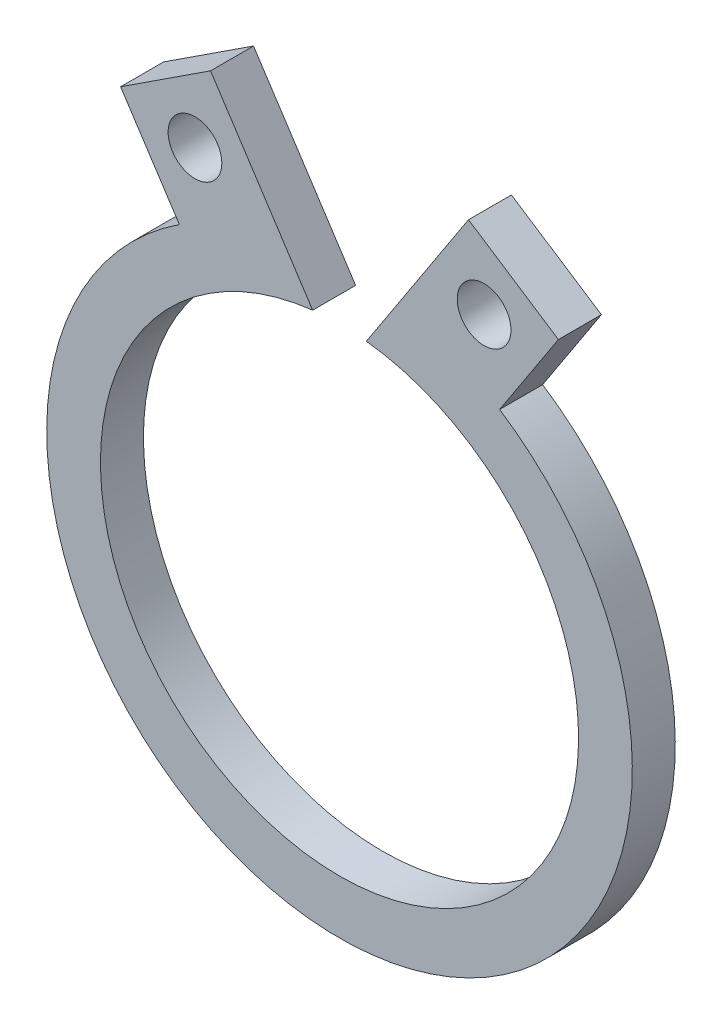
ISO-10303-21;
HEADER;
FILE_DESCRIPTION(('STEP AP214'),'2;1');
FILE_NAME('part.step','',(''),(''),'','','');
FILE_SCHEMA(('AUTOMOTIVE_DESIGN { 1 0 10303 214 1 1 1 1 }'));
ENDSEC;
DATA;
#1=APPLICATION_CONTEXT('core data for automotive mechanical design processes');
#2=APPLICATION_PROTOCOL_DEFINITION('international standard','automotive_design',2000,#1);
#3=PRODUCT_CONTEXT('',#1,'mechanical');
#4=PRODUCT('Part','Part','',(#3));
#5=PRODUCT_RELATED_PRODUCT_CATEGORY('part','',(#4));
#6=PRODUCT_DEFINITION_FORMATION('','',#4);
#7=PRODUCT_DEFINITION_CONTEXT('part definition',#1,'design');
#8=PRODUCT_DEFINITION('design','',#6,#7);
#9=PRODUCT_DEFINITION_SHAPE('','',#8);
#10=(LENGTH_UNIT() NAMED_UNIT(*) SI_UNIT(.MILLI.,.METRE.));
#11=(NAMED_UNIT(*) PLANE_ANGLE_UNIT() SI_UNIT($,.RADIAN.));
#12=(NAMED_UNIT(*) SI_UNIT($,.STERADIAN.) SOLID_ANGLE_UNIT());
#13=UNCERTAINTY_MEASURE_WITH_UNIT(LENGTH_MEASURE(1.E-05),#10,'distance_accuracy_value','');
#14=(GEOMETRIC_REPRESENTATION_CONTEXT(3) GLOBAL_UNCERTAINTY_ASSIGNED_CONTEXT((#13)) GLOBAL_UNIT_ASSIGNED_CONTEXT((#10,
#11,#12)) REPRESENTATION_CONTEXT('',''));
#15=CARTESIAN_POINT('',(0.,0.,0.));
#16=DIRECTION('',(0.,0.,1.));
#17=DIRECTION('',(1.,0.,0.));
#18=AXIS2_PLACEMENT_3D('',#15,#16,#17);
#19=CARTESIAN_POINT('',(-4.07488371674846,6.23681190152295,0.8));
#20=DIRECTION('',(0.546964257281672,-0.837155959935966,0.));
#21=DIRECTION('',(0.837155959935966,0.546964257281672,0.));
#22=AXIS2_PLACEMENT_3D('',#19,#20,#21);
#23=PLANE('',#22);
#24=DIRECTION('',(-0.837155959935966,-0.546964257281672,0.));
#25=VECTOR('',#24,1.);
#26=CARTESIAN_POINT('',(-4.07488371674846,6.23681190152295,0.));
#27=LINE('',#26,#25);
#28=CARTESIAN_POINT('',(-2.40057179687652,7.33074041608629,0.));
#29=VERTEX_POINT('',#28);
#30=CARTESIAN_POINT('',(-4.07488371674846,6.23681190152295,0.));
#31=VERTEX_POINT('',#30);
#32=EDGE_CURVE('E129',#29,#31,#27,.T.);
#33=ORIENTED_EDGE('',*,*,#32,.T.);
#34=DIRECTION('',(0.,0.,-1.));
#35=VECTOR('',#34,1.);
#36=CARTESIAN_POINT('',(-4.07488371674846,6.23681190152295,0.8));
#37=LINE('',#36,#35);
#38=CARTESIAN_POINT('',(-4.07488371674846,6.23681190152295,0.8));
#39=VERTEX_POINT('',#38);
#40=EDGE_CURVE('E11',#39,#31,#37,.T.);
#41=ORIENTED_EDGE('',*,*,#40,.F.);
#42=DIRECTION('',(-0.837155959935966,-0.546964257281672,0.));
#43=VECTOR('',#42,1.);
#44=CARTESIAN_POINT('',(-4.07488371674846,6.23681190152295,0.8));
#45=LINE('',#44,#43);
#46=CARTESIAN_POINT('',(-2.40057179687652,7.33074041608629,0.8));
#47=VERTEX_POINT('',#46);
#48=EDGE_CURVE('E144',#47,#39,#45,.T.);
#49=ORIENTED_EDGE('',*,*,#48,.F.);
#50=DIRECTION('',(0.,0.,-1.));
#51=VECTOR('',#50,1.);
#52=CARTESIAN_POINT('',(-2.40057179687652,7.33074041608629,0.8));
#53=LINE('',#52,#51);
#54=EDGE_CURVE('E125',#47,#29,#53,.T.);
#55=ORIENTED_EDGE('',*,*,#54,.T.);
#56=EDGE_LOOP('',(#33,#41,#49,#55));
#57=FACE_BOUND('',#56,.T.);
#58=ADVANCED_FACE('F33',(#57),#23,.F.);
#59=CARTESIAN_POINT('',(-4.07488371674846,6.23681190152295,0.8));
#60=DIRECTION('',(0.837155959935966,0.546964257281672,0.));
#61=DIRECTION('',(-0.546964257281672,0.837155959935966,0.));
#62=AXIS2_PLACEMENT_3D('',#59,#60,#61);
#63=PLANE('',#62);
#64=DIRECTION('',(0.546964257281672,-0.837155959935966,0.));
#65=VECTOR('',#64,1.);
#66=CARTESIAN_POINT('',(-4.07488371674846,6.23681190152295,0.));
#67=LINE('',#66,#65);
#68=CARTESIAN_POINT('',(-2.98095520218511,4.56249998165102,0.));
#69=VERTEX_POINT('',#68);
#70=EDGE_CURVE('E132',#31,#69,#67,.T.);
#71=ORIENTED_EDGE('',*,*,#70,.T.);
#72=DIRECTION('',(0.,0.,-1.));
#73=VECTOR('',#72,1.);
#74=CARTESIAN_POINT('',(-2.98095520218511,4.56249998165102,0.8));
#75=LINE('',#74,#73);
#76=CARTESIAN_POINT('',(-2.98095520218511,4.56249998165102,0.8));
#77=VERTEX_POINT('',#76);
#78=EDGE_CURVE('E41',#77,#69,#75,.T.);
#79=ORIENTED_EDGE('',*,*,#78,.F.);
#80=DIRECTION('',(0.546964257281672,-0.837155959935966,0.));
#81=VECTOR('',#80,1.);
#82=CARTESIAN_POINT('',(-4.07488371674846,6.23681190152295,0.8));
#83=LINE('',#82,#81);
#84=EDGE_CURVE('E92',#39,#77,#83,.T.);
#85=ORIENTED_EDGE('',*,*,#84,.F.);
#86=ORIENTED_EDGE('',*,*,#40,.T.);
#87=EDGE_LOOP('',(#71,#79,#85,#86));
#88=FACE_BOUND('',#87,.T.);
#89=ADVANCED_FACE('F213',(#88),#63,.F.);
#90=CARTESIAN_POINT('',(0.,0.,0.8));
#91=DIRECTION('',(0.,0.,-1.));
#92=DIRECTION('',(-1.,0.,0.));
#93=AXIS2_PLACEMENT_3D('',#90,#91,#92);
#94=CYLINDRICAL_SURFACE('',#93,5.45);
#95=CARTESIAN_POINT('',(0.,0.,0.));
#96=DIRECTION('',(0.,0.,1.));
#97=DIRECTION('',(1.,0.,0.));
#98=AXIS2_PLACEMENT_3D('',#95,#96,#97);
#99=CIRCLE('',#98,5.45);
#100=CARTESIAN_POINT('',(2.98095520218511,4.56249998165102,0.));
#101=VERTEX_POINT('',#100);
#102=EDGE_CURVE('E135',#69,#101,#99,.T.);
#103=ORIENTED_EDGE('',*,*,#102,.T.);
#104=DIRECTION('',(0.,0.,-1.));
#105=VECTOR('',#104,1.);
#106=CARTESIAN_POINT('',(2.98095520218511,4.56249998165102,0.8));
#107=LINE('',#106,#105);
#108=CARTESIAN_POINT('',(2.98095520218511,4.56249998165102,0.8));
#109=VERTEX_POINT('',#108);
#110=EDGE_CURVE('E151',#109,#101,#107,.T.);
#111=ORIENTED_EDGE('',*,*,#110,.F.);
#112=CARTESIAN_POINT('',(0.,0.,0.8));
#113=DIRECTION('',(0.,0.,1.));
#114=DIRECTION('',(1.,0.,0.));
#115=AXIS2_PLACEMENT_3D('',#112,#113,#114);
#116=CIRCLE('',#115,5.45);
#117=EDGE_CURVE('E159',#77,#109,#116,.T.);
#118=ORIENTED_EDGE('',*,*,#117,.F.);
#119=ORIENTED_EDGE('',*,*,#78,.T.);
#120=EDGE_LOOP('',(#103,#111,#118,#119));
#121=FACE_BOUND('',#120,.T.);
#122=ADVANCED_FACE('F157',(#121),#94,.T.);
#123=CARTESIAN_POINT('',(4.07488371674846,6.23681190152295,0.8));
#124=DIRECTION('',(-0.837155959935966,0.546964257281672,0.));
#125=DIRECTION('',(-0.546964257281672,-0.837155959935966,0.));
#126=AXIS2_PLACEMENT_3D('',#123,#124,#125);
#127=PLANE('',#126);
#128=DIRECTION('',(0.546964257281672,0.837155959935966,0.));
#129=VECTOR('',#128,1.);
#130=CARTESIAN_POINT('',(4.07488371674846,6.23681190152295,0.));
#131=LINE('',#130,#129);
#132=CARTESIAN_POINT('',(4.07488371674846,6.23681190152295,0.));
#133=VERTEX_POINT('',#132);
#134=EDGE_CURVE('E137',#101,#133,#131,.T.);
#135=ORIENTED_EDGE('',*,*,#134,.T.);
#136=DIRECTION('',(0.,0.,-1.));
#137=VECTOR('',#136,1.);
#138=CARTESIAN_POINT('',(4.07488371674846,6.23681190152295,0.8));
#139=LINE('',#138,#137);
#140=CARTESIAN_POINT('',(4.07488371674846,6.23681190152295,0.8));
#141=VERTEX_POINT('',#140);
#142=EDGE_CURVE('E148',#141,#133,#139,.T.);
#143=ORIENTED_EDGE('',*,*,#142,.F.);
#144=DIRECTION('',(0.546964257281672,0.837155959935966,0.));
#145=VECTOR('',#144,1.);
#146=CARTESIAN_POINT('',(4.07488371674846,6.23681190152295,0.8));
#147=LINE('',#146,#145);
#148=EDGE_CURVE('E171',#109,#141,#147,.T.);
#149=ORIENTED_EDGE('',*,*,#148,.F.);
#150=ORIENTED_EDGE('',*,*,#110,.T.);
#151=EDGE_LOOP('',(#135,#143,#149,#150));
#152=FACE_BOUND('',#151,.T.);
#153=ADVANCED_FACE('F167',(#152),#127,.F.);
#154=CARTESIAN_POINT('',(4.07488371674846,6.23681190152295,0.8));
#155=DIRECTION('',(-0.546964257281672,-0.837155959935966,0.));
#156=DIRECTION('',(0.837155959935966,-0.546964257281672,0.));
#157=AXIS2_PLACEMENT_3D('',#154,#155,#156);
#158=PLANE('',#157);
#159=DIRECTION('',(-0.837155959935966,0.546964257281672,0.));
#160=VECTOR('',#159,1.);
#161=CARTESIAN_POINT('',(4.07488371674846,6.23681190152295,0.));
#162=LINE('',#161,#160);
#163=CARTESIAN_POINT('',(2.40057179687652,7.33074041608629,0.));
#164=VERTEX_POINT('',#163);
#165=EDGE_CURVE('E139',#133,#164,#162,.T.);
#166=ORIENTED_EDGE('',*,*,#165,.T.);
#167=DIRECTION('',(0.,0.,-1.));
#168=VECTOR('',#167,1.);
#169=CARTESIAN_POINT('',(2.40057179687652,7.33074041608629,0.8));
#170=LINE('',#169,#168);
#171=CARTESIAN_POINT('',(2.40057179687652,7.33074041608629,0.8));
#172=VERTEX_POINT('',#171);
#173=EDGE_CURVE('E120',#172,#164,#170,.T.);
#174=ORIENTED_EDGE('',*,*,#173,.F.);
#175=DIRECTION('',(-0.837155959935966,0.546964257281672,0.));
#176=VECTOR('',#175,1.);
#177=CARTESIAN_POINT('',(4.07488371674846,6.23681190152295,0.8));
#178=LINE('',#177,#176);
#179=EDGE_CURVE('E111',#141,#172,#178,.T.);
#180=ORIENTED_EDGE('',*,*,#179,.F.);
#181=ORIENTED_EDGE('',*,*,#142,.T.);
#182=EDGE_LOOP('',(#166,#174,#180,#181));
#183=FACE_BOUND('',#182,.T.);
#184=ADVANCED_FACE('F170',(#183),#158,.F.);
#185=CARTESIAN_POINT('',(2.40057179687652,7.33074041608629,0.8));
#186=DIRECTION('',(0.837155959935966,-0.546964257281672,0.));
#187=DIRECTION('',(0.546964257281672,0.837155959935966,0.));
#188=AXIS2_PLACEMENT_3D('',#185,#186,#187);
#189=PLANE('',#188);
#190=DIRECTION('',(-0.546964257281672,-0.837155959935966,0.));
#191=VECTOR('',#190,1.);
#192=CARTESIAN_POINT('',(2.40057179687652,7.33074041608629,0.));
#193=LINE('',#192,#191);
#194=CARTESIAN_POINT('',(0.5,4.4218208918951,0.));
#195=VERTEX_POINT('',#194);
#196=EDGE_CURVE('E119',#164,#195,#193,.T.);
#197=ORIENTED_EDGE('',*,*,#196,.T.);
#198=DIRECTION('',(0.,0.,-1.));
#199=VECTOR('',#198,1.);
#200=CARTESIAN_POINT('',(0.5,4.4218208918951,0.8));
#201=LINE('',#200,#199);
#202=CARTESIAN_POINT('',(0.5,4.4218208918951,0.8));
#203=VERTEX_POINT('',#202);
#204=EDGE_CURVE('E116',#203,#195,#201,.T.);
#205=ORIENTED_EDGE('',*,*,#204,.F.);
#206=DIRECTION('',(-0.546964257281672,-0.837155959935966,0.));
#207=VECTOR('',#206,1.);
#208=CARTESIAN_POINT('',(2.40057179687652,7.33074041608629,0.8));
#209=LINE('',#208,#207);
#210=EDGE_CURVE('E105',#172,#203,#209,.T.);
#211=ORIENTED_EDGE('',*,*,#210,.F.);
#212=ORIENTED_EDGE('',*,*,#173,.T.);
#213=EDGE_LOOP('',(#197,#205,#211,#212));
#214=FACE_BOUND('',#213,.T.);
#215=ADVANCED_FACE('F117',(#214),#189,.F.);
#216=CARTESIAN_POINT('',(0.,0.,0.8));
#217=DIRECTION('',(0.,0.,-1.));
#218=DIRECTION('',(-1.,0.,0.));
#219=AXIS2_PLACEMENT_3D('',#216,#217,#218);
#220=CYLINDRICAL_SURFACE('',#219,4.45);
#221=CARTESIAN_POINT('',(0.,0.,0.));
#222=DIRECTION('',(0.,0.,-1.));
#223=DIRECTION('',(1.,0.,0.));
#224=AXIS2_PLACEMENT_3D('',#221,#222,#223);
#225=CIRCLE('',#224,4.45);
#226=CARTESIAN_POINT('',(-0.5,4.4218208918951,0.));
#227=VERTEX_POINT('',#226);
#228=EDGE_CURVE('E78',#195,#227,#225,.T.);
#229=ORIENTED_EDGE('',*,*,#228,.T.);
#230=DIRECTION('',(0.,0.,-1.));
#231=VECTOR('',#230,1.);
#232=CARTESIAN_POINT('',(-0.5,4.4218208918951,0.8));
#233=LINE('',#232,#231);
#234=CARTESIAN_POINT('',(-0.5,4.4218208918951,0.8));
#235=VERTEX_POINT('',#234);
#236=EDGE_CURVE('E121',#235,#227,#233,.T.);
#237=ORIENTED_EDGE('',*,*,#236,.F.);
#238=CARTESIAN_POINT('',(0.,0.,0.8));
#239=DIRECTION('',(0.,0.,-1.));
#240=DIRECTION('',(1.,0.,0.));
#241=AXIS2_PLACEMENT_3D('',#238,#239,#240);
#242=CIRCLE('',#241,4.45);
#243=EDGE_CURVE('E109',#203,#235,#242,.T.);
#244=ORIENTED_EDGE('',*,*,#243,.F.);
#245=ORIENTED_EDGE('',*,*,#204,.T.);
#246=EDGE_LOOP('',(#229,#237,#244,#245));
#247=FACE_BOUND('',#246,.T.);
#248=ADVANCED_FACE('F123',(#247),#220,.F.);
#249=CARTESIAN_POINT('',(-2.40057179687652,7.33074041608629,0.8));
#250=DIRECTION('',(-0.837155959935966,-0.546964257281672,0.));
#251=DIRECTION('',(0.546964257281672,-0.837155959935966,0.));
#252=AXIS2_PLACEMENT_3D('',#249,#250,#251);
#253=PLANE('',#252);
#254=DIRECTION('',(-0.546964257281672,0.837155959935966,0.));
#255=VECTOR('',#254,1.);
#256=CARTESIAN_POINT('',(-2.40057179687652,7.33074041608629,0.));
#257=LINE('',#256,#255);
#258=EDGE_CURVE('E84',#227,#29,#257,.T.);
#259=ORIENTED_EDGE('',*,*,#258,.T.);
#260=ORIENTED_EDGE('',*,*,#54,.F.);
#261=DIRECTION('',(-0.546964257281672,0.837155959935966,0.));
#262=VECTOR('',#261,1.);
#263=CARTESIAN_POINT('',(-2.40057179687652,7.33074041608629,0.8));
#264=LINE('',#263,#262);
#265=EDGE_CURVE('E49',#235,#47,#264,.T.);
#266=ORIENTED_EDGE('',*,*,#265,.F.);
#267=ORIENTED_EDGE('',*,*,#236,.T.);
#268=EDGE_LOOP('',(#259,#260,#266,#267));
#269=FACE_BOUND('',#268,.T.);
#270=ADVANCED_FACE('F200',(#269),#253,.F.);
#271=CARTESIAN_POINT('',(0.,0.,0.8));
#272=DIRECTION('',(0.,0.,1.));
#273=DIRECTION('',(1.,0.,0.));
#274=AXIS2_PLACEMENT_3D('',#271,#272,#273);
#275=PLANE('',#274);
#276=CARTESIAN_POINT('',(-2.69076349953082,5.94662019886866,0.8));
#277=DIRECTION('',(0.,0.,1.));
#278=DIRECTION('',(1.,0.,0.));
#279=AXIS2_PLACEMENT_3D('',#276,#277,#278);
#280=CIRCLE('',#279,0.5);
#281=CARTESIAN_POINT('',(-2.19076349953082,5.94662019886866,0.8));
#282=VERTEX_POINT('',#281);
#283=EDGE_CURVE('E183',#282,#282,#280,.T.);
#284=ORIENTED_EDGE('',*,*,#283,.F.);
#285=EDGE_LOOP('',(#284));
#286=FACE_BOUND('',#285,.T.);
#287=CARTESIAN_POINT('',(2.69076349953082,5.94662019886866,0.8));
#288=DIRECTION('',(0.,0.,1.));
#289=DIRECTION('',(1.,0.,0.));
#290=AXIS2_PLACEMENT_3D('',#287,#288,#289);
#291=CIRCLE('',#290,0.5);
#292=CARTESIAN_POINT('',(3.19076349953082,5.94662019886866,0.8));
#293=VERTEX_POINT('',#292);
#294=EDGE_CURVE('E180',#293,#293,#291,.T.);
#295=ORIENTED_EDGE('',*,*,#294,.F.);
#296=EDGE_LOOP('',(#295));
#297=FACE_BOUND('',#296,.T.);
#298=ORIENTED_EDGE('',*,*,#48,.T.);
#299=ORIENTED_EDGE('',*,*,#84,.T.);
#300=ORIENTED_EDGE('',*,*,#117,.T.);
#301=ORIENTED_EDGE('',*,*,#148,.T.);
#302=ORIENTED_EDGE('',*,*,#179,.T.);
#303=ORIENTED_EDGE('',*,*,#210,.T.);
#304=ORIENTED_EDGE('',*,*,#243,.T.);
#305=ORIENTED_EDGE('',*,*,#265,.T.);
#306=EDGE_LOOP('',(#298,#299,#300,#301,#302,#303,#304,#305));
#307=FACE_BOUND('',#306,.T.);
#308=ADVANCED_FACE('F107',(#286,#297,#307),#275,.T.);
#309=CARTESIAN_POINT('',(0.,0.,0.));
#310=DIRECTION('',(0.,0.,1.));
#311=DIRECTION('',(1.,0.,0.));
#312=AXIS2_PLACEMENT_3D('',#309,#310,#311);
#313=PLANE('',#312);
#314=CARTESIAN_POINT('',(-2.69076349953082,5.94662019886866,0.));
#315=DIRECTION('',(0.,0.,1.));
#316=DIRECTION('',(1.,0.,0.));
#317=AXIS2_PLACEMENT_3D('',#314,#315,#316);
#318=CIRCLE('',#317,0.5);
#319=CARTESIAN_POINT('',(-2.19076349953082,5.94662019886866,0.));
#320=VERTEX_POINT('',#319);
#321=EDGE_CURVE('E133',#320,#320,#318,.T.);
#322=ORIENTED_EDGE('',*,*,#321,.T.);
#323=EDGE_LOOP('',(#322));
#324=FACE_BOUND('',#323,.T.);
#325=CARTESIAN_POINT('',(2.69076349953082,5.94662019886866,0.));
#326=DIRECTION('',(0.,0.,1.));
#327=DIRECTION('',(1.,0.,0.));
#328=AXIS2_PLACEMENT_3D('',#325,#326,#327);
#329=CIRCLE('',#328,0.5);
#330=CARTESIAN_POINT('',(3.19076349953082,5.94662019886866,0.));
#331=VERTEX_POINT('',#330);
#332=EDGE_CURVE('E177',#331,#331,#329,.T.);
#333=ORIENTED_EDGE('',*,*,#332,.T.);
#334=EDGE_LOOP('',(#333));
#335=FACE_BOUND('',#334,.T.);
#336=ORIENTED_EDGE('',*,*,#32,.F.);
#337=ORIENTED_EDGE('',*,*,#258,.F.);
#338=ORIENTED_EDGE('',*,*,#228,.F.);
#339=ORIENTED_EDGE('',*,*,#196,.F.);
#340=ORIENTED_EDGE('',*,*,#165,.F.);
#341=ORIENTED_EDGE('',*,*,#134,.F.);
#342=ORIENTED_EDGE('',*,*,#102,.F.);
#343=ORIENTED_EDGE('',*,*,#70,.F.);
#344=EDGE_LOOP('',(#336,#337,#338,#339,#340,#341,#342,#343));
#345=FACE_BOUND('',#344,.T.);
#346=ADVANCED_FACE('F163',(#324,#335,#345),#313,.F.);
#347=CARTESIAN_POINT('',(2.69076349953082,5.94662019886866,0.));
#348=DIRECTION('',(0.,0.,1.));
#349=DIRECTION('',(1.,0.,0.));
#350=AXIS2_PLACEMENT_3D('',#347,#348,#349);
#351=CYLINDRICAL_SURFACE('',#350,0.5);
#352=ORIENTED_EDGE('',*,*,#332,.F.);
#353=EDGE_LOOP('',(#352));
#354=FACE_BOUND('',#353,.T.);
#355=ORIENTED_EDGE('',*,*,#294,.T.);
#356=EDGE_LOOP('',(#355));
#357=FACE_BOUND('',#356,.T.);
#358=ADVANCED_FACE('F194',(#354,#357),#351,.F.);
#359=CARTESIAN_POINT('',(-2.69076349953082,5.94662019886866,0.));
#360=DIRECTION('',(0.,0.,1.));
#361=DIRECTION('',(1.,0.,0.));
#362=AXIS2_PLACEMENT_3D('',#359,#360,#361);
#363=CYLINDRICAL_SURFACE('',#362,0.5);
#364=ORIENTED_EDGE('',*,*,#321,.F.);
#365=EDGE_LOOP('',(#364));
#366=FACE_BOUND('',#365,.T.);
#367=ORIENTED_EDGE('',*,*,#283,.T.);
#368=EDGE_LOOP('',(#367));
#369=FACE_BOUND('',#368,.T.);
#370=ADVANCED_FACE('F191',(#366,#369),#363,.F.);
#371=CLOSED_SHELL('',(#58,#89,#122,#153,#184,#215,#248,#270,#308,#346,#358,#370));
#372=MANIFOLD_SOLID_BREP('B2',#371);
#373=ADVANCED_BREP_SHAPE_REPRESENTATION('',(#18,#372),#14);
#374=SHAPE_DEFINITION_REPRESENTATION(#9,#373);
ENDSEC;
END-ISO-10303-21;
